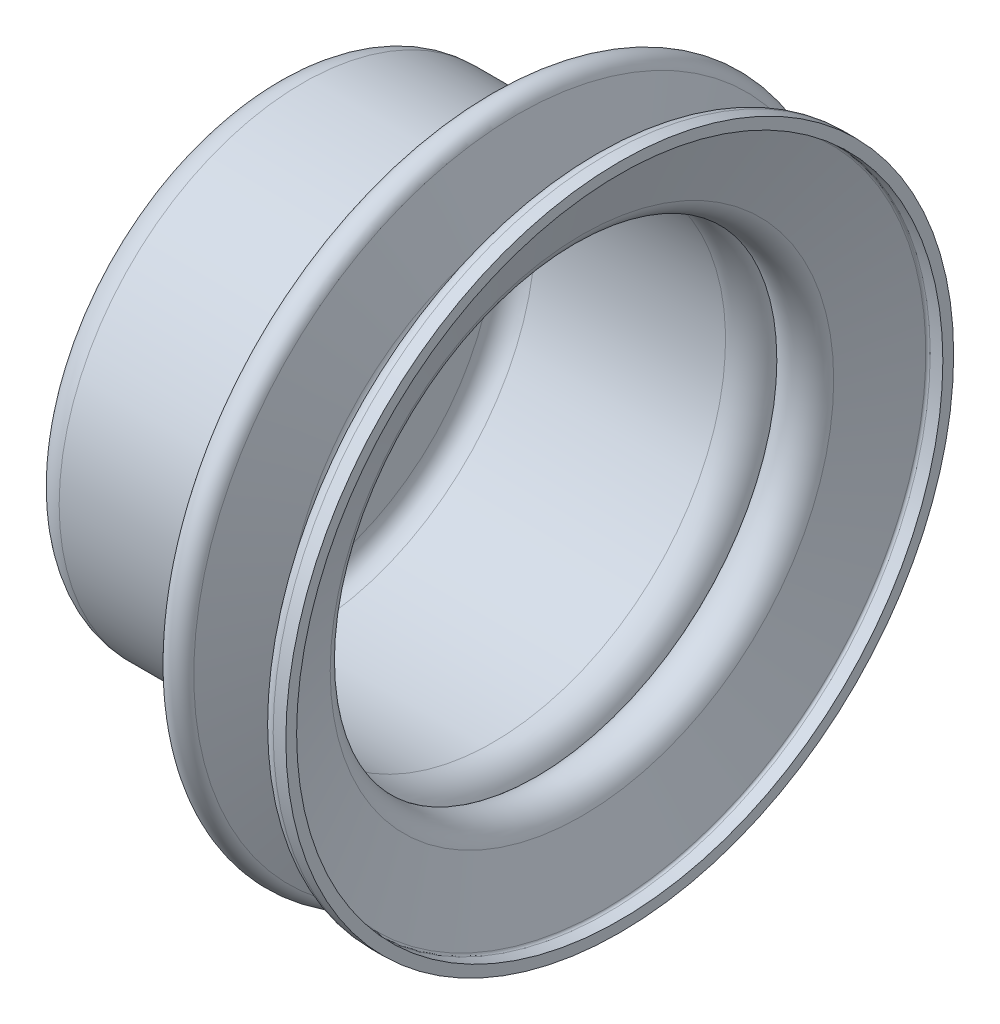
ISO-10303-21;
HEADER;
FILE_DESCRIPTION(('STEP AP214'),'2;1');
FILE_NAME('part.step','',(''),(''),'','','');
FILE_SCHEMA(('AUTOMOTIVE_DESIGN { 1 0 10303 214 1 1 1 1 }'));
ENDSEC;
DATA;
#1=APPLICATION_CONTEXT('core data for automotive mechanical design processes');
#2=APPLICATION_PROTOCOL_DEFINITION('international standard','automotive_design',2000,#1);
#3=PRODUCT_CONTEXT('',#1,'mechanical');
#4=PRODUCT('Part','Part','',(#3));
#5=PRODUCT_RELATED_PRODUCT_CATEGORY('part','',(#4));
#6=PRODUCT_DEFINITION_FORMATION('','',#4);
#7=PRODUCT_DEFINITION_CONTEXT('part definition',#1,'design');
#8=PRODUCT_DEFINITION('design','',#6,#7);
#9=PRODUCT_DEFINITION_SHAPE('','',#8);
#10=(LENGTH_UNIT() NAMED_UNIT(*) SI_UNIT(.MILLI.,.METRE.));
#11=(NAMED_UNIT(*) PLANE_ANGLE_UNIT() SI_UNIT($,.RADIAN.));
#12=(NAMED_UNIT(*) SI_UNIT($,.STERADIAN.) SOLID_ANGLE_UNIT());
#13=UNCERTAINTY_MEASURE_WITH_UNIT(LENGTH_MEASURE(1.E-05),#10,'distance_accuracy_value','');
#14=(GEOMETRIC_REPRESENTATION_CONTEXT(3) GLOBAL_UNCERTAINTY_ASSIGNED_CONTEXT((#13)) GLOBAL_UNIT_ASSIGNED_CONTEXT((#10,
#11,#12)) REPRESENTATION_CONTEXT('',''));
#15=CARTESIAN_POINT('',(0.,0.,0.));
#16=DIRECTION('',(0.,0.,1.));
#17=DIRECTION('',(1.,0.,0.));
#18=AXIS2_PLACEMENT_3D('',#15,#16,#17);
#19=CARTESIAN_POINT('',(-208.8719952478,225.,-10.));
#20=DIRECTION('',(-1.,0.,0.));
#21=DIRECTION('',(0.,1.,0.));
#22=AXIS2_PLACEMENT_3D('',#19,#20,#21);
#23=TOROIDAL_SURFACE('',#22,47.5,0.4);
#24=CARTESIAN_POINT('',(-209.252417854287,225.,-10.));
#25=DIRECTION('',(1.,0.,0.));
#26=DIRECTION('',(0.,-1.,0.));
#27=AXIS2_PLACEMENT_3D('',#24,#25,#26);
#28=CIRCLE('',#27,47.6236067977197);
#29=CARTESIAN_POINT('',(-209.252417854287,177.37639320228,-10.));
#30=VERTEX_POINT('',#29);
#31=EDGE_CURVE('E267',#30,#30,#28,.F.);
#32=ORIENTED_EDGE('',*,*,#31,.T.);
#33=EDGE_LOOP('',(#32));
#34=FACE_BOUND('',#33,.T.);
#35=CARTESIAN_POINT('',(-208.8719952478,225.,-10.));
#36=DIRECTION('',(-1.,0.,0.));
#37=DIRECTION('',(0.,0.,1.));
#38=AXIS2_PLACEMENT_3D('',#35,#36,#37);
#39=CIRCLE('',#38,47.9);
#40=CARTESIAN_POINT('',(-208.8719952478,225.,37.9));
#41=VERTEX_POINT('',#40);
#42=EDGE_CURVE('E512',#41,#41,#39,.F.);
#43=ORIENTED_EDGE('',*,*,#42,.T.);
#44=EDGE_LOOP('',(#43));
#45=FACE_BOUND('',#44,.T.);
#46=ADVANCED_FACE('F16',(#34,#45),#23,.F.);
#47=CARTESIAN_POINT('',(-204.5,225.,-10.));
#48=DIRECTION('',(-1.,0.,0.));
#49=DIRECTION('',(0.,0.,1.));
#50=AXIS2_PLACEMENT_3D('',#47,#48,#49);
#51=CYLINDRICAL_SURFACE('',#50,47.9);
#52=ORIENTED_EDGE('',*,*,#42,.F.);
#53=EDGE_LOOP('',(#52));
#54=FACE_BOUND('',#53,.T.);
#55=CARTESIAN_POINT('',(-207.,225.,-10.));
#56=DIRECTION('',(-1.,0.,0.));
#57=DIRECTION('',(0.,0.,1.));
#58=AXIS2_PLACEMENT_3D('',#55,#56,#57);
#59=CIRCLE('',#58,47.9);
#60=CARTESIAN_POINT('',(-207.,225.,37.9));
#61=VERTEX_POINT('',#60);
#62=EDGE_CURVE('E264',#61,#61,#59,.F.);
#63=ORIENTED_EDGE('',*,*,#62,.T.);
#64=EDGE_LOOP('',(#63));
#65=FACE_BOUND('',#64,.T.);
#66=ADVANCED_FACE('F154',(#54,#65),#51,.F.);
#67=CARTESIAN_POINT('',(-209.252417854287,225.,-10.));
#68=DIRECTION('',(1.,0.,0.));
#69=DIRECTION('',(0.,0.,-1.));
#70=AXIS2_PLACEMENT_3D('',#67,#68,#69);
#71=CONICAL_SURFACE('',#70,47.6236067977197,1.25663706143721);
#72=CARTESIAN_POINT('',(-212.6006682832,225.,-10.));
#73=DIRECTION('',(-1.,0.,0.));
#74=DIRECTION('',(0.,1.,0.));
#75=AXIS2_PLACEMENT_3D('',#72,#73,#74);
#76=CIRCLE('',#75,37.3187515743002);
#77=CARTESIAN_POINT('',(-212.6006682832,262.3187515743,-10.));
#78=VERTEX_POINT('',#77);
#79=EDGE_CURVE('E263',#78,#78,#76,.F.);
#80=ORIENTED_EDGE('',*,*,#79,.F.);
#81=EDGE_LOOP('',(#80));
#82=FACE_BOUND('',#81,.T.);
#83=ORIENTED_EDGE('',*,*,#31,.F.);
#84=EDGE_LOOP('',(#83));
#85=FACE_BOUND('',#84,.T.);
#86=ADVANCED_FACE('F151',(#82,#85),#71,.F.);
#87=CARTESIAN_POINT('',(-207.,225.,-10.));
#88=DIRECTION('',(-1.,0.,0.));
#89=DIRECTION('',(0.,0.,1.));
#90=AXIS2_PLACEMENT_3D('',#87,#88,#89);
#91=PLANE('',#90);
#92=ORIENTED_EDGE('',*,*,#62,.F.);
#93=EDGE_LOOP('',(#92));
#94=FACE_BOUND('',#93,.T.);
#95=CARTESIAN_POINT('',(-207.,225.,-10.));
#96=DIRECTION('',(-1.,0.,0.));
#97=DIRECTION('',(0.,0.,1.));
#98=AXIS2_PLACEMENT_3D('',#95,#96,#97);
#99=CIRCLE('',#98,49.5);
#100=CARTESIAN_POINT('',(-207.,225.,39.5));
#101=VERTEX_POINT('',#100);
#102=EDGE_CURVE('E260',#101,#101,#99,.T.);
#103=ORIENTED_EDGE('',*,*,#102,.F.);
#104=EDGE_LOOP('',(#103));
#105=FACE_BOUND('',#104,.T.);
#106=ADVANCED_FACE('F147',(#94,#105),#91,.F.);
#107=CARTESIAN_POINT('',(-216.5,225.,-10.));
#108=DIRECTION('',(-1.,0.,0.));
#109=DIRECTION('',(0.,1.,0.));
#110=AXIS2_PLACEMENT_3D('',#107,#108,#109);
#111=TOROIDAL_SURFACE('',#110,38.58572125127,4.1);
#112=CARTESIAN_POINT('',(-220.399331716777,225.,-10.));
#113=DIRECTION('',(-1.,0.,0.));
#114=DIRECTION('',(0.,1.,0.));
#115=AXIS2_PLACEMENT_3D('',#112,#113,#114);
#116=CIRCLE('',#115,37.3187515742416);
#117=CARTESIAN_POINT('',(-220.399331716777,262.318751574242,-10.));
#118=VERTEX_POINT('',#117);
#119=EDGE_CURVE('E140',#118,#118,#116,.T.);
#120=ORIENTED_EDGE('',*,*,#119,.T.);
#121=EDGE_LOOP('',(#120));
#122=FACE_BOUND('',#121,.T.);
#123=ORIENTED_EDGE('',*,*,#79,.T.);
#124=EDGE_LOOP('',(#123));
#125=FACE_BOUND('',#124,.T.);
#126=ADVANCED_FACE('F143',(#122,#125),#111,.T.);
#127=CARTESIAN_POINT('',(-204.42,225.,-10.));
#128=DIRECTION('',(-1.,0.,0.));
#129=DIRECTION('',(0.,0.,1.));
#130=AXIS2_PLACEMENT_3D('',#127,#128,#129);
#131=CYLINDRICAL_SURFACE('',#130,49.5);
#132=ORIENTED_EDGE('',*,*,#102,.T.);
#133=EDGE_LOOP('',(#132));
#134=FACE_BOUND('',#133,.T.);
#135=CARTESIAN_POINT('',(-208.8719952478,225.,-10.));
#136=DIRECTION('',(-1.,0.,0.));
#137=DIRECTION('',(0.,-1.,0.));
#138=AXIS2_PLACEMENT_3D('',#135,#136,#137);
#139=CIRCLE('',#138,49.5);
#140=CARTESIAN_POINT('',(-208.8719952478,175.5,-10.));
#141=VERTEX_POINT('',#140);
#142=EDGE_CURVE('E137',#141,#141,#139,.T.);
#143=ORIENTED_EDGE('',*,*,#142,.F.);
#144=EDGE_LOOP('',(#143));
#145=FACE_BOUND('',#144,.T.);
#146=ADVANCED_FACE('F146',(#134,#145),#131,.T.);
#147=CARTESIAN_POINT('',(-221.439960670722,225.,-10.));
#148=DIRECTION('',(-1.,0.,0.));
#149=DIRECTION('',(0.,0.,1.));
#150=AXIS2_PLACEMENT_3D('',#147,#148,#149);
#151=CONICAL_SURFACE('',#150,40.5214781740369,1.25663706142968);
#152=CARTESIAN_POINT('',(-221.439960670731,225.,-10.));
#153=DIRECTION('',(-1.,0.,0.));
#154=DIRECTION('',(0.,1.,0.));
#155=AXIS2_PLACEMENT_3D('',#152,#153,#154);
#156=CIRCLE('',#155,40.52147817409);
#157=CARTESIAN_POINT('',(-221.439960670731,265.52147817409,-10.));
#158=VERTEX_POINT('',#157);
#159=EDGE_CURVE('E116',#158,#158,#156,.F.);
#160=ORIENTED_EDGE('',*,*,#159,.F.);
#161=EDGE_LOOP('',(#160));
#162=FACE_BOUND('',#161,.T.);
#163=ORIENTED_EDGE('',*,*,#119,.F.);
#164=EDGE_LOOP('',(#163));
#165=FACE_BOUND('',#164,.T.);
#166=ADVANCED_FACE('F130',(#162,#165),#151,.F.);
#167=CARTESIAN_POINT('',(-208.8719952478,225.,-10.));
#168=DIRECTION('',(-1.,0.,0.));
#169=DIRECTION('',(0.,-1.,0.));
#170=AXIS2_PLACEMENT_3D('',#167,#168,#169);
#171=TOROIDAL_SURFACE('',#170,47.5,2.);
#172=ORIENTED_EDGE('',*,*,#142,.T.);
#173=EDGE_LOOP('',(#172));
#174=FACE_BOUND('',#173,.T.);
#175=CARTESIAN_POINT('',(-210.774108280361,225.,-10.));
#176=DIRECTION('',(1.,0.,0.));
#177=DIRECTION('',(0.,1.,0.));
#178=AXIS2_PLACEMENT_3D('',#175,#176,#177);
#179=CIRCLE('',#178,48.1180339886805);
#180=CARTESIAN_POINT('',(-210.774108280361,273.118033988681,-10.));
#181=VERTEX_POINT('',#180);
#182=EDGE_CURVE('E113',#181,#181,#179,.F.);
#183=ORIENTED_EDGE('',*,*,#182,.F.);
#184=EDGE_LOOP('',(#183));
#185=FACE_BOUND('',#184,.T.);
#186=ADVANCED_FACE('F126',(#174,#185),#171,.T.);
#187=CARTESIAN_POINT('',(-225.8148206457,225.,-10.));
#188=DIRECTION('',(-1.,0.,0.));
#189=DIRECTION('',(0.,1.,0.));
#190=AXIS2_PLACEMENT_3D('',#187,#188,#189);
#191=TOROIDAL_SURFACE('',#190,39.1,4.6);
#192=CARTESIAN_POINT('',(-225.8148206457,225.,-10.));
#193=DIRECTION('',(-1.,0.,0.));
#194=DIRECTION('',(0.,0.,1.));
#195=AXIS2_PLACEMENT_3D('',#192,#193,#194);
#196=CIRCLE('',#195,34.5);
#197=CARTESIAN_POINT('',(-225.8148206457,225.,24.5));
#198=VERTEX_POINT('',#197);
#199=EDGE_CURVE('E110',#198,#198,#196,.T.);
#200=ORIENTED_EDGE('',*,*,#199,.T.);
#201=EDGE_LOOP('',(#200));
#202=FACE_BOUND('',#201,.T.);
#203=ORIENTED_EDGE('',*,*,#159,.T.);
#204=EDGE_LOOP('',(#203));
#205=FACE_BOUND('',#204,.T.);
#206=ADVANCED_FACE('F121',(#202,#205),#191,.T.);
#207=CARTESIAN_POINT('',(-210.774108280361,225.,-10.));
#208=DIRECTION('',(1.,0.,0.));
#209=DIRECTION('',(0.,0.,-1.));
#210=AXIS2_PLACEMENT_3D('',#207,#208,#209);
#211=CONICAL_SURFACE('',#210,48.1180339886805,1.25663706143721);
#212=ORIENTED_EDGE('',*,*,#182,.T.);
#213=EDGE_LOOP('',(#212));
#214=FACE_BOUND('',#213,.T.);
#215=CARTESIAN_POINT('',(-214.122358709275,225.,-10.));
#216=DIRECTION('',(-1.,0.,0.));
#217=DIRECTION('',(0.,-1.,0.));
#218=AXIS2_PLACEMENT_3D('',#215,#216,#217);
#219=CIRCLE('',#218,37.813178765292);
#220=CARTESIAN_POINT('',(-214.122358709275,187.186821234708,-10.));
#221=VERTEX_POINT('',#220);
#222=EDGE_CURVE('E107',#221,#221,#219,.F.);
#223=ORIENTED_EDGE('',*,*,#222,.T.);
#224=EDGE_LOOP('',(#223));
#225=FACE_BOUND('',#224,.T.);
#226=ADVANCED_FACE('F125',(#214,#225),#211,.T.);
#227=CARTESIAN_POINT('',(-204.5,225.,-10.));
#228=DIRECTION('',(-1.,0.,0.));
#229=DIRECTION('',(0.,0.,1.));
#230=AXIS2_PLACEMENT_3D('',#227,#228,#229);
#231=CYLINDRICAL_SURFACE('',#230,34.5);
#232=CARTESIAN_POINT('',(-254.,225.,-10.));
#233=DIRECTION('',(-1.,0.,0.));
#234=DIRECTION('',(0.,1.,0.));
#235=AXIS2_PLACEMENT_3D('',#232,#233,#234);
#236=CIRCLE('',#235,34.5);
#237=CARTESIAN_POINT('',(-254.,259.5,-10.));
#238=VERTEX_POINT('',#237);
#239=EDGE_CURVE('E89',#238,#238,#236,.T.);
#240=ORIENTED_EDGE('',*,*,#239,.T.);
#241=EDGE_LOOP('',(#240));
#242=FACE_BOUND('',#241,.T.);
#243=ORIENTED_EDGE('',*,*,#199,.F.);
#244=EDGE_LOOP('',(#243));
#245=FACE_BOUND('',#244,.T.);
#246=ADVANCED_FACE('F336',(#242,#245),#231,.F.);
#247=CARTESIAN_POINT('',(-216.5,225.,-10.));
#248=DIRECTION('',(-1.,0.,0.));
#249=DIRECTION('',(0.,-1.,0.));
#250=AXIS2_PLACEMENT_3D('',#247,#248,#249);
#251=TOROIDAL_SURFACE('',#250,38.58572125127,2.5);
#252=ORIENTED_EDGE('',*,*,#222,.F.);
#253=EDGE_LOOP('',(#252));
#254=FACE_BOUND('',#253,.T.);
#255=CARTESIAN_POINT('',(-218.877641290703,225.,-10.));
#256=DIRECTION('',(-1.,0.,0.));
#257=DIRECTION('',(0.,-1.,0.));
#258=AXIS2_PLACEMENT_3D('',#255,#256,#257);
#259=CIRCLE('',#258,37.8131787652819);
#260=CARTESIAN_POINT('',(-218.877641290703,187.186821234718,-10.));
#261=VERTEX_POINT('',#260);
#262=EDGE_CURVE('E58',#261,#261,#259,.T.);
#263=ORIENTED_EDGE('',*,*,#262,.F.);
#264=EDGE_LOOP('',(#263));
#265=FACE_BOUND('',#264,.T.);
#266=ADVANCED_FACE('F94',(#254,#265),#251,.F.);
#267=CARTESIAN_POINT('',(-254.,225.,-10.));
#268=DIRECTION('',(-1.,0.,0.));
#269=DIRECTION('',(0.,1.,0.));
#270=AXIS2_PLACEMENT_3D('',#267,#268,#269);
#271=TOROIDAL_SURFACE('',#270,31.5,3.);
#272=CARTESIAN_POINT('',(-257.,225.,-10.));
#273=DIRECTION('',(-1.,0.,0.));
#274=DIRECTION('',(0.,-1.,0.));
#275=AXIS2_PLACEMENT_3D('',#272,#273,#274);
#276=CIRCLE('',#275,31.5);
#277=CARTESIAN_POINT('',(-257.,193.5,-10.));
#278=VERTEX_POINT('',#277);
#279=CARTESIAN_POINT('',(-257.,256.5,-10.));
#280=VERTEX_POINT('',#279);
#281=EDGE_CURVE('E47',#278,#280,#276,.T.);
#282=ORIENTED_EDGE('',*,*,#281,.T.);
#283=CARTESIAN_POINT('',(-257.,225.,-10.));
#284=DIRECTION('',(-1.,0.,0.));
#285=DIRECTION('',(0.,1.,0.));
#286=AXIS2_PLACEMENT_3D('',#283,#284,#285);
#287=CIRCLE('',#286,31.5);
#288=EDGE_CURVE('E45',#280,#278,#287,.T.);
#289=ORIENTED_EDGE('',*,*,#288,.T.);
#290=EDGE_LOOP('',(#282,#289));
#291=FACE_BOUND('',#290,.T.);
#292=ORIENTED_EDGE('',*,*,#239,.F.);
#293=EDGE_LOOP('',(#292));
#294=FACE_BOUND('',#293,.T.);
#295=ADVANCED_FACE('F49',(#291,#294),#271,.F.);
#296=CARTESIAN_POINT('',(-222.177518664608,225.,-10.));
#297=DIRECTION('',(-1.,0.,0.));
#298=DIRECTION('',(0.,0.,1.));
#299=AXIS2_PLACEMENT_3D('',#296,#297,#298);
#300=CONICAL_SURFACE('',#299,47.9691570336399,1.25663706143571);
#301=ORIENTED_EDGE('',*,*,#262,.T.);
#302=EDGE_LOOP('',(#301));
#303=FACE_BOUND('',#302,.T.);
#304=CARTESIAN_POINT('',(-222.177518664673,225.,-10.));
#305=DIRECTION('',(-1.,0.,0.));
#306=DIRECTION('',(0.,-1.,0.));
#307=AXIS2_PLACEMENT_3D('',#304,#305,#306);
#308=CIRCLE('',#307,47.9691570336763);
#309=CARTESIAN_POINT('',(-222.177518664673,177.030842966324,-10.));
#310=VERTEX_POINT('',#309);
#311=EDGE_CURVE('E53',#310,#310,#308,.T.);
#312=ORIENTED_EDGE('',*,*,#311,.F.);
#313=EDGE_LOOP('',(#312));
#314=FACE_BOUND('',#313,.T.);
#315=ADVANCED_FACE('F76',(#303,#314),#300,.T.);
#316=CARTESIAN_POINT('',(-257.,225.,-10.));
#317=DIRECTION('',(-1.,0.,0.));
#318=DIRECTION('',(0.,0.,1.));
#319=AXIS2_PLACEMENT_3D('',#316,#317,#318);
#320=PLANE('',#319);
#321=CARTESIAN_POINT('',(-257.,250.,-10.));
#322=DIRECTION('',(1.,0.,0.));
#323=DIRECTION('',(0.,0.,-1.));
#324=AXIS2_PLACEMENT_3D('',#321,#322,#323);
#325=CIRCLE('',#324,3.25);
#326=CARTESIAN_POINT('',(-257.,250.,-13.25));
#327=VERTEX_POINT('',#326);
#328=EDGE_CURVE('E236',#327,#327,#325,.F.);
#329=ORIENTED_EDGE('',*,*,#328,.T.);
#330=EDGE_LOOP('',(#329));
#331=FACE_BOUND('',#330,.T.);
#332=CARTESIAN_POINT('',(-257.,225.,15.));
#333=DIRECTION('',(1.,0.,0.));
#334=DIRECTION('',(0.,0.,-1.));
#335=AXIS2_PLACEMENT_3D('',#332,#333,#334);
#336=CIRCLE('',#335,3.25);
#337=CARTESIAN_POINT('',(-257.,225.,11.75));
#338=VERTEX_POINT('',#337);
#339=EDGE_CURVE('E244',#338,#338,#336,.F.);
#340=ORIENTED_EDGE('',*,*,#339,.T.);
#341=EDGE_LOOP('',(#340));
#342=FACE_BOUND('',#341,.T.);
#343=CARTESIAN_POINT('',(-257.,200.,-10.));
#344=DIRECTION('',(1.,0.,0.));
#345=DIRECTION('',(0.,0.,-1.));
#346=AXIS2_PLACEMENT_3D('',#343,#344,#345);
#347=CIRCLE('',#346,3.25);
#348=CARTESIAN_POINT('',(-257.,200.,-13.25));
#349=VERTEX_POINT('',#348);
#350=EDGE_CURVE('E248',#349,#349,#347,.F.);
#351=ORIENTED_EDGE('',*,*,#350,.T.);
#352=EDGE_LOOP('',(#351));
#353=FACE_BOUND('',#352,.T.);
#354=CARTESIAN_POINT('',(-257.,225.,-35.));
#355=DIRECTION('',(1.,0.,0.));
#356=DIRECTION('',(0.,0.,-1.));
#357=AXIS2_PLACEMENT_3D('',#354,#355,#356);
#358=CIRCLE('',#357,3.25);
#359=CARTESIAN_POINT('',(-257.,225.,-38.25));
#360=VERTEX_POINT('',#359);
#361=EDGE_CURVE('E254',#360,#360,#358,.F.);
#362=ORIENTED_EDGE('',*,*,#361,.T.);
#363=EDGE_LOOP('',(#362));
#364=FACE_BOUND('',#363,.T.);
#365=CARTESIAN_POINT('',(-257.,225.,-10.));
#366=DIRECTION('',(1.,0.,0.));
#367=DIRECTION('',(0.,0.,-1.));
#368=AXIS2_PLACEMENT_3D('',#365,#366,#367);
#369=CIRCLE('',#368,14.);
#370=CARTESIAN_POINT('',(-257.,225.,-24.));
#371=VERTEX_POINT('',#370);
#372=EDGE_CURVE('E257',#371,#371,#369,.F.);
#373=ORIENTED_EDGE('',*,*,#372,.T.);
#374=EDGE_LOOP('',(#373));
#375=FACE_BOUND('',#374,.T.);
#376=ORIENTED_EDGE('',*,*,#288,.F.);
#377=ORIENTED_EDGE('',*,*,#281,.F.);
#378=EDGE_LOOP('',(#376,#377));
#379=FACE_BOUND('',#378,.T.);
#380=ADVANCED_FACE('F57',(#331,#342,#353,#364,#375,#379),#320,.F.);
#381=CARTESIAN_POINT('',(-224.2845432466,225.,-10.));
#382=DIRECTION('',(-1.,0.,0.));
#383=DIRECTION('',(0.,-1.,0.));
#384=AXIS2_PLACEMENT_3D('',#381,#382,#383);
#385=TOROIDAL_SURFACE('',#384,47.28454324656,2.215456753438);
#386=ORIENTED_EDGE('',*,*,#311,.T.);
#387=EDGE_LOOP('',(#386));
#388=FACE_BOUND('',#387,.T.);
#389=CARTESIAN_POINT('',(-225.04631017669,225.,-10.));
#390=DIRECTION('',(-1.,0.,0.));
#391=DIRECTION('',(0.,-0.999987808102023,-0.00493798008418315));
#392=AXIS2_PLACEMENT_3D('',#389,#390,#391);
#393=CIRCLE('',#392,45.2041683355268);
#394=CARTESIAN_POINT('',(-225.04631017669,179.796382789082,-10.2232172829629));
#395=VERTEX_POINT('',#394);
#396=EDGE_CURVE('E233',#395,#395,#393,.F.);
#397=ORIENTED_EDGE('',*,*,#396,.T.);
#398=EDGE_LOOP('',(#397));
#399=FACE_BOUND('',#398,.T.);
#400=ADVANCED_FACE('F75',(#388,#399),#385,.T.);
#401=CARTESIAN_POINT('',(-257.,225.,-10.));
#402=DIRECTION('',(1.,0.,0.));
#403=DIRECTION('',(0.,0.,-1.));
#404=AXIS2_PLACEMENT_3D('',#401,#402,#403);
#405=CYLINDRICAL_SURFACE('',#404,14.);
#406=ORIENTED_EDGE('',*,*,#372,.F.);
#407=EDGE_LOOP('',(#406));
#408=FACE_BOUND('',#407,.T.);
#409=CARTESIAN_POINT('',(-258.6,225.,-10.));
#410=DIRECTION('',(1.,0.,0.));
#411=DIRECTION('',(0.,0.,-1.));
#412=AXIS2_PLACEMENT_3D('',#409,#410,#411);
#413=CIRCLE('',#412,14.);
#414=CARTESIAN_POINT('',(-258.6,225.,-24.));
#415=VERTEX_POINT('',#414);
#416=EDGE_CURVE('E235',#415,#415,#413,.T.);
#417=ORIENTED_EDGE('',*,*,#416,.F.);
#418=EDGE_LOOP('',(#417));
#419=FACE_BOUND('',#418,.T.);
#420=ADVANCED_FACE('F311',(#408,#419),#405,.F.);
#421=CARTESIAN_POINT('',(-257.,225.,-35.));
#422=DIRECTION('',(1.,0.,0.));
#423=DIRECTION('',(0.,0.,-1.));
#424=AXIS2_PLACEMENT_3D('',#421,#422,#423);
#425=CYLINDRICAL_SURFACE('',#424,3.25);
#426=ORIENTED_EDGE('',*,*,#361,.F.);
#427=EDGE_LOOP('',(#426));
#428=FACE_BOUND('',#427,.T.);
#429=CARTESIAN_POINT('',(-258.6,225.,-35.));
#430=DIRECTION('',(1.,0.,0.));
#431=DIRECTION('',(0.,0.,-1.));
#432=AXIS2_PLACEMENT_3D('',#429,#430,#431);
#433=CIRCLE('',#432,3.25);
#434=CARTESIAN_POINT('',(-258.6,225.,-38.25));
#435=VERTEX_POINT('',#434);
#436=EDGE_CURVE('E241',#435,#435,#433,.T.);
#437=ORIENTED_EDGE('',*,*,#436,.F.);
#438=EDGE_LOOP('',(#437));
#439=FACE_BOUND('',#438,.T.);
#440=ADVANCED_FACE('F308',(#428,#439),#425,.F.);
#441=CARTESIAN_POINT('',(-257.,200.,-10.));
#442=DIRECTION('',(1.,0.,0.));
#443=DIRECTION('',(0.,0.,-1.));
#444=AXIS2_PLACEMENT_3D('',#441,#442,#443);
#445=CYLINDRICAL_SURFACE('',#444,3.25);
#446=ORIENTED_EDGE('',*,*,#350,.F.);
#447=EDGE_LOOP('',(#446));
#448=FACE_BOUND('',#447,.T.);
#449=CARTESIAN_POINT('',(-258.6,200.,-10.));
#450=DIRECTION('',(1.,0.,0.));
#451=DIRECTION('',(0.,0.,-1.));
#452=AXIS2_PLACEMENT_3D('',#449,#450,#451);
#453=CIRCLE('',#452,3.25);
#454=CARTESIAN_POINT('',(-258.6,200.,-13.25));
#455=VERTEX_POINT('',#454);
#456=EDGE_CURVE('E520',#455,#455,#453,.T.);
#457=ORIENTED_EDGE('',*,*,#456,.F.);
#458=EDGE_LOOP('',(#457));
#459=FACE_BOUND('',#458,.T.);
#460=ADVANCED_FACE('F301',(#448,#459),#445,.F.);
#461=CARTESIAN_POINT('',(-257.,225.,15.));
#462=DIRECTION('',(1.,0.,0.));
#463=DIRECTION('',(0.,0.,-1.));
#464=AXIS2_PLACEMENT_3D('',#461,#462,#463);
#465=CYLINDRICAL_SURFACE('',#464,3.25);
#466=ORIENTED_EDGE('',*,*,#339,.F.);
#467=EDGE_LOOP('',(#466));
#468=FACE_BOUND('',#467,.T.);
#469=CARTESIAN_POINT('',(-258.6,225.,15.));
#470=DIRECTION('',(1.,0.,0.));
#471=DIRECTION('',(0.,0.,-1.));
#472=AXIS2_PLACEMENT_3D('',#469,#470,#471);
#473=CIRCLE('',#472,3.25);
#474=CARTESIAN_POINT('',(-258.6,225.,11.75));
#475=VERTEX_POINT('',#474);
#476=EDGE_CURVE('E517',#475,#475,#473,.T.);
#477=ORIENTED_EDGE('',*,*,#476,.F.);
#478=EDGE_LOOP('',(#477));
#479=FACE_BOUND('',#478,.T.);
#480=ADVANCED_FACE('F296',(#468,#479),#465,.F.);
#481=CARTESIAN_POINT('',(-257.,250.,-10.));
#482=DIRECTION('',(1.,0.,0.));
#483=DIRECTION('',(0.,0.,-1.));
#484=AXIS2_PLACEMENT_3D('',#481,#482,#483);
#485=CYLINDRICAL_SURFACE('',#484,3.25);
#486=ORIENTED_EDGE('',*,*,#328,.F.);
#487=EDGE_LOOP('',(#486));
#488=FACE_BOUND('',#487,.T.);
#489=CARTESIAN_POINT('',(-258.6,250.,-10.));
#490=DIRECTION('',(1.,0.,0.));
#491=DIRECTION('',(0.,0.,-1.));
#492=AXIS2_PLACEMENT_3D('',#489,#490,#491);
#493=CIRCLE('',#492,3.25);
#494=CARTESIAN_POINT('',(-258.6,250.,-13.25));
#495=VERTEX_POINT('',#494);
#496=EDGE_CURVE('E192',#495,#495,#493,.T.);
#497=ORIENTED_EDGE('',*,*,#496,.F.);
#498=EDGE_LOOP('',(#497));
#499=FACE_BOUND('',#498,.T.);
#500=ADVANCED_FACE('F292',(#488,#499),#485,.F.);
#501=CARTESIAN_POINT('',(-225.3901521835,225.,-10.));
#502=DIRECTION('',(-1.,0.,0.));
#503=DIRECTION('',(0.,-0.999987808102023,-0.00493798008418312));
#504=AXIS2_PLACEMENT_3D('',#501,#502,#503);
#505=TOROIDAL_SURFACE('',#504,44.2651408203,1.);
#506=CARTESIAN_POINT('',(-224.439095604254,225.,-10.));
#507=DIRECTION('',(-1.,0.,0.));
#508=DIRECTION('',(0.,-1.,0.));
#509=AXIS2_PLACEMENT_3D('',#506,#507,#508);
#510=CIRCLE('',#509,44.5741576207638);
#511=CARTESIAN_POINT('',(-224.439095604254,180.425842379236,-10.));
#512=VERTEX_POINT('',#511);
#513=EDGE_CURVE('E190',#512,#512,#510,.F.);
#514=ORIENTED_EDGE('',*,*,#513,.T.);
#515=EDGE_LOOP('',(#514));
#516=FACE_BOUND('',#515,.T.);
#517=ORIENTED_EDGE('',*,*,#396,.F.);
#518=EDGE_LOOP('',(#517));
#519=FACE_BOUND('',#518,.T.);
#520=ADVANCED_FACE('F209',(#516,#519),#505,.F.);
#521=CARTESIAN_POINT('',(-258.6,225.,-10.));
#522=DIRECTION('',(-1.,0.,0.));
#523=DIRECTION('',(0.,0.,1.));
#524=AXIS2_PLACEMENT_3D('',#521,#522,#523);
#525=PLANE('',#524);
#526=ORIENTED_EDGE('',*,*,#496,.T.);
#527=EDGE_LOOP('',(#526));
#528=FACE_BOUND('',#527,.T.);
#529=ORIENTED_EDGE('',*,*,#476,.T.);
#530=EDGE_LOOP('',(#529));
#531=FACE_BOUND('',#530,.T.);
#532=ORIENTED_EDGE('',*,*,#456,.T.);
#533=EDGE_LOOP('',(#532));
#534=FACE_BOUND('',#533,.T.);
#535=ORIENTED_EDGE('',*,*,#436,.T.);
#536=EDGE_LOOP('',(#535));
#537=FACE_BOUND('',#536,.T.);
#538=ORIENTED_EDGE('',*,*,#416,.T.);
#539=EDGE_LOOP('',(#538));
#540=FACE_BOUND('',#539,.T.);
#541=CARTESIAN_POINT('',(-258.6,225.,-10.));
#542=DIRECTION('',(1.,0.,0.));
#543=DIRECTION('',(0.,-1.,0.));
#544=AXIS2_PLACEMENT_3D('',#541,#542,#543);
#545=CIRCLE('',#544,31.5);
#546=CARTESIAN_POINT('',(-258.6,193.5,-10.));
#547=VERTEX_POINT('',#546);
#548=CARTESIAN_POINT('',(-258.6,256.5,-10.));
#549=VERTEX_POINT('',#548);
#550=EDGE_CURVE('E36',#547,#549,#545,.T.);
#551=ORIENTED_EDGE('',*,*,#550,.F.);
#552=CARTESIAN_POINT('',(-258.6,225.,-10.));
#553=DIRECTION('',(1.,0.,0.));
#554=DIRECTION('',(0.,1.,0.));
#555=AXIS2_PLACEMENT_3D('',#552,#553,#554);
#556=CIRCLE('',#555,31.5);
#557=EDGE_CURVE('E187',#549,#547,#556,.T.);
#558=ORIENTED_EDGE('',*,*,#557,.F.);
#559=EDGE_LOOP('',(#551,#558));
#560=FACE_BOUND('',#559,.T.);
#561=ADVANCED_FACE('F199',(#528,#531,#534,#537,#540,#560),#525,.T.);
#562=CARTESIAN_POINT('',(-224.439095604282,225.,-10.));
#563=DIRECTION('',(-1.,0.,0.));
#564=DIRECTION('',(0.,0.,1.));
#565=AXIS2_PLACEMENT_3D('',#562,#563,#564);
#566=CONICAL_SURFACE('',#565,44.5741576208206,1.25663706143358);
#567=CARTESIAN_POINT('',(-222.961651096806,225.,-10.));
#568=DIRECTION('',(-1.,0.,0.));
#569=DIRECTION('',(0.,-1.,0.));
#570=AXIS2_PLACEMENT_3D('',#567,#568,#569);
#571=CIRCLE('',#570,40.0270509830981);
#572=CARTESIAN_POINT('',(-222.961651096806,184.972949016902,-10.));
#573=VERTEX_POINT('',#572);
#574=EDGE_CURVE('E185',#573,#573,#571,.F.);
#575=ORIENTED_EDGE('',*,*,#574,.T.);
#576=EDGE_LOOP('',(#575));
#577=FACE_BOUND('',#576,.T.);
#578=ORIENTED_EDGE('',*,*,#513,.F.);
#579=EDGE_LOOP('',(#578));
#580=FACE_BOUND('',#579,.T.);
#581=ADVANCED_FACE('F208',(#577,#580),#566,.F.);
#582=CARTESIAN_POINT('',(-254.,225.,-10.));
#583=DIRECTION('',(-1.,0.,0.));
#584=DIRECTION('',(0.,-1.,0.));
#585=AXIS2_PLACEMENT_3D('',#582,#583,#584);
#586=TOROIDAL_SURFACE('',#585,31.5,4.6);
#587=CARTESIAN_POINT('',(-254.,225.,-10.));
#588=DIRECTION('',(-1.,0.,0.));
#589=DIRECTION('',(0.,0.,1.));
#590=AXIS2_PLACEMENT_3D('',#587,#588,#589);
#591=CIRCLE('',#590,36.1);
#592=CARTESIAN_POINT('',(-254.,225.,26.1));
#593=VERTEX_POINT('',#592);
#594=EDGE_CURVE('E28',#593,#593,#591,.F.);
#595=ORIENTED_EDGE('',*,*,#594,.F.);
#596=EDGE_LOOP('',(#595));
#597=FACE_BOUND('',#596,.T.);
#598=ORIENTED_EDGE('',*,*,#557,.T.);
#599=ORIENTED_EDGE('',*,*,#550,.T.);
#600=EDGE_LOOP('',(#598,#599));
#601=FACE_BOUND('',#600,.T.);
#602=ADVANCED_FACE('F173',(#597,#601),#586,.T.);
#603=CARTESIAN_POINT('',(-225.8148206457,225.,-10.));
#604=DIRECTION('',(-1.,0.,0.));
#605=DIRECTION('',(0.,-1.,0.));
#606=AXIS2_PLACEMENT_3D('',#603,#604,#605);
#607=TOROIDAL_SURFACE('',#606,39.1,3.);
#608=ORIENTED_EDGE('',*,*,#574,.F.);
#609=EDGE_LOOP('',(#608));
#610=FACE_BOUND('',#609,.T.);
#611=CARTESIAN_POINT('',(-225.8148206457,225.,-10.));
#612=DIRECTION('',(-1.,0.,0.));
#613=DIRECTION('',(0.,0.,1.));
#614=AXIS2_PLACEMENT_3D('',#611,#612,#613);
#615=CIRCLE('',#614,36.1);
#616=CARTESIAN_POINT('',(-225.8148206457,225.,26.1));
#617=VERTEX_POINT('',#616);
#618=EDGE_CURVE('E11',#617,#617,#615,.T.);
#619=ORIENTED_EDGE('',*,*,#618,.F.);
#620=EDGE_LOOP('',(#619));
#621=FACE_BOUND('',#620,.T.);
#622=ADVANCED_FACE('F167',(#610,#621),#607,.F.);
#623=CARTESIAN_POINT('',(-204.42,225.,-10.));
#624=DIRECTION('',(-1.,0.,0.));
#625=DIRECTION('',(0.,0.,1.));
#626=AXIS2_PLACEMENT_3D('',#623,#624,#625);
#627=CYLINDRICAL_SURFACE('',#626,36.1);
#628=ORIENTED_EDGE('',*,*,#618,.T.);
#629=EDGE_LOOP('',(#628));
#630=FACE_BOUND('',#629,.T.);
#631=ORIENTED_EDGE('',*,*,#594,.T.);
#632=EDGE_LOOP('',(#631));
#633=FACE_BOUND('',#632,.T.);
#634=ADVANCED_FACE('F165',(#630,#633),#627,.T.);
#635=CLOSED_SHELL('',(#46,#66,#86,#106,#126,#146,#166,#186,#206,#226,#246,#266,#295,#315,#380,
#400,#420,#440,#460,#480,#500,#520,#561,#581,#602,#622,#634));
#636=MANIFOLD_SOLID_BREP('B1',#635);
#637=ADVANCED_BREP_SHAPE_REPRESENTATION('',(#18,#636),#14);
#638=SHAPE_DEFINITION_REPRESENTATION(#9,#637);
ENDSEC;
END-ISO-10303-21;
